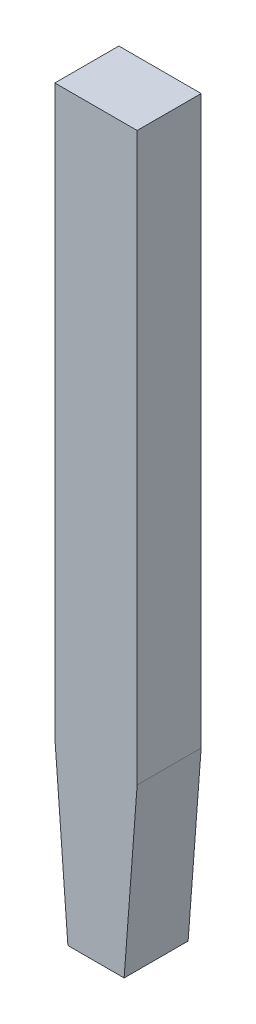
ISO-10303-21;
HEADER;
FILE_DESCRIPTION(('STEP AP214'),'2;1');
FILE_NAME('part.step','',(''),(''),'','','');
FILE_SCHEMA(('AUTOMOTIVE_DESIGN { 1 0 10303 214 1 1 1 1 }'));
ENDSEC;
DATA;
#1=APPLICATION_CONTEXT('core data for automotive mechanical design processes');
#2=APPLICATION_PROTOCOL_DEFINITION('international standard','automotive_design',2000,#1);
#3=PRODUCT_CONTEXT('',#1,'mechanical');
#4=PRODUCT('Part','Part','',(#3));
#5=PRODUCT_RELATED_PRODUCT_CATEGORY('part','',(#4));
#6=PRODUCT_DEFINITION_FORMATION('','',#4);
#7=PRODUCT_DEFINITION_CONTEXT('part definition',#1,'design');
#8=PRODUCT_DEFINITION('design','',#6,#7);
#9=PRODUCT_DEFINITION_SHAPE('','',#8);
#10=(LENGTH_UNIT() NAMED_UNIT(*) SI_UNIT(.MILLI.,.METRE.));
#11=(NAMED_UNIT(*) PLANE_ANGLE_UNIT() SI_UNIT($,.RADIAN.));
#12=(NAMED_UNIT(*) SI_UNIT($,.STERADIAN.) SOLID_ANGLE_UNIT());
#13=UNCERTAINTY_MEASURE_WITH_UNIT(LENGTH_MEASURE(1.E-05),#10,'distance_accuracy_value','');
#14=(GEOMETRIC_REPRESENTATION_CONTEXT(3) GLOBAL_UNCERTAINTY_ASSIGNED_CONTEXT((#13)) GLOBAL_UNIT_ASSIGNED_CONTEXT((#10,
#11,#12)) REPRESENTATION_CONTEXT('',''));
#15=CARTESIAN_POINT('',(0.,0.,0.));
#16=DIRECTION('',(0.,0.,1.));
#17=DIRECTION('',(1.,0.,0.));
#18=AXIS2_PLACEMENT_3D('',#15,#16,#17);
#19=CARTESIAN_POINT('',(47.87457889831,-0.5212621897839,1.165000000046));
#20=DIRECTION('',(0.,0.,1.));
#21=DIRECTION('',(1.,0.,0.));
#22=AXIS2_PLACEMENT_3D('',#19,#20,#21);
#23=PLANE('',#22);
#24=DIRECTION('',(1.,0.,0.));
#25=VECTOR('',#24,1.);
#26=CARTESIAN_POINT('',(38.93957889831,-15.17126218978,1.165000000046));
#27=LINE('',#26,#25);
#28=CARTESIAN_POINT('',(48.17082889831,-15.17126218978,1.165000000046));
#29=VERTEX_POINT('',#28);
#30=CARTESIAN_POINT('',(48.47832889831,-15.17126218978,1.165000000046));
#31=VERTEX_POINT('',#30);
#32=EDGE_CURVE('E94',#29,#31,#27,.T.);
#33=ORIENTED_EDGE('',*,*,#32,.T.);
#34=DIRECTION('',(0.0747899482416168,0.997199309888458,0.));
#35=VECTOR('',#34,1.);
#36=CARTESIAN_POINT('',(48.54957889831,-14.22126218978,1.165000000046));
#37=LINE('',#36,#35);
#38=CARTESIAN_POINT('',(48.54957889831,-14.2212621897804,1.165000000046));
#39=VERTEX_POINT('',#38);
#40=EDGE_CURVE('E98',#39,#31,#37,.F.);
#41=ORIENTED_EDGE('',*,*,#40,.F.);
#42=DIRECTION('',(0.,1.,0.));
#43=VECTOR('',#42,1.);
#44=CARTESIAN_POINT('',(48.54957889831,-7.321262189784,1.165000000046));
#45=LINE('',#44,#43);
#46=CARTESIAN_POINT('',(48.54957889831,-11.12202888849,1.165000000046));
#47=VERTEX_POINT('',#46);
#48=EDGE_CURVE('E83',#47,#39,#45,.F.);
#49=ORIENTED_EDGE('',*,*,#48,.F.);
#50=DIRECTION('',(1.,0.,0.));
#51=VECTOR('',#50,1.);
#52=CARTESIAN_POINT('',(44.47457889831,-11.12202888849,1.165000000046));
#53=LINE('',#52,#51);
#54=CARTESIAN_POINT('',(48.09957889831,-11.12202888849,1.165000000046));
#55=VERTEX_POINT('',#54);
#56=EDGE_CURVE('E20',#47,#55,#53,.F.);
#57=ORIENTED_EDGE('',*,*,#56,.T.);
#58=DIRECTION('',(0.,1.,0.));
#59=VECTOR('',#58,1.);
#60=CARTESIAN_POINT('',(48.09957889831,-7.321262189784,1.165000000046));
#61=LINE('',#60,#59);
#62=CARTESIAN_POINT('',(48.09957889831,-14.2212621897798,1.165000000046));
#63=VERTEX_POINT('',#62);
#64=EDGE_CURVE('E71',#63,#55,#61,.T.);
#65=ORIENTED_EDGE('',*,*,#64,.F.);
#66=DIRECTION('',(0.0747899482416168,-0.997199309888458,0.));
#67=VECTOR('',#66,1.);
#68=CARTESIAN_POINT('',(48.09957889831,-14.22126218978,1.165000000046));
#69=LINE('',#68,#67);
#70=EDGE_CURVE('E66',#29,#63,#69,.F.);
#71=ORIENTED_EDGE('',*,*,#70,.F.);
#72=EDGE_LOOP('',(#33,#41,#49,#57,#65,#71));
#73=FACE_BOUND('',#72,.T.);
#74=ADVANCED_FACE('F17',(#73),#23,.T.);
#75=CARTESIAN_POINT('',(44.47457889831,-11.12202888849,-0.158278306686));
#76=DIRECTION('',(0.,-1.,0.));
#77=DIRECTION('',(0.,0.,-1.));
#78=AXIS2_PLACEMENT_3D('',#75,#76,#77);
#79=PLANE('',#78);
#80=DIRECTION('',(1.,0.,0.));
#81=VECTOR('',#80,1.);
#82=CARTESIAN_POINT('',(47.87457889831,-11.12202888849,0.8150000000459));
#83=LINE('',#82,#81);
#84=CARTESIAN_POINT('',(48.54957889831,-11.12202888849,0.8150000000459));
#85=VERTEX_POINT('',#84);
#86=CARTESIAN_POINT('',(48.09957889831,-11.12202888849,0.8150000000459));
#87=VERTEX_POINT('',#86);
#88=EDGE_CURVE('E89',#85,#87,#83,.F.);
#89=ORIENTED_EDGE('',*,*,#88,.T.);
#90=DIRECTION('',(0.,0.,1.));
#91=VECTOR('',#90,1.);
#92=CARTESIAN_POINT('',(48.09957889831,-11.12202888849,0.8150000000459));
#93=LINE('',#92,#91);
#94=EDGE_CURVE('E76',#55,#87,#93,.F.);
#95=ORIENTED_EDGE('',*,*,#94,.F.);
#96=ORIENTED_EDGE('',*,*,#56,.F.);
#97=DIRECTION('',(0.,0.,-1.));
#98=VECTOR('',#97,1.);
#99=CARTESIAN_POINT('',(48.54957889831,-11.12202888849,0.8150000000459));
#100=LINE('',#99,#98);
#101=EDGE_CURVE('E102',#85,#47,#100,.F.);
#102=ORIENTED_EDGE('',*,*,#101,.F.);
#103=EDGE_LOOP('',(#89,#95,#96,#102));
#104=FACE_BOUND('',#103,.T.);
#105=ADVANCED_FACE('F88',(#104),#79,.F.);
#106=CARTESIAN_POINT('',(48.09957889831,-7.321262189784,0.8150000000459));
#107=DIRECTION('',(-1.,0.,0.));
#108=DIRECTION('',(0.,0.,1.));
#109=AXIS2_PLACEMENT_3D('',#106,#107,#108);
#110=PLANE('',#109);
#111=DIRECTION('',(0.,1.,0.));
#112=VECTOR('',#111,1.);
#113=CARTESIAN_POINT('',(48.09957889831,-0.5212621897839,0.8150000000459));
#114=LINE('',#113,#112);
#115=CARTESIAN_POINT('',(48.09957889831,-14.2212621897799,0.8150000000459));
#116=VERTEX_POINT('',#115);
#117=EDGE_CURVE('E107',#87,#116,#114,.F.);
#118=ORIENTED_EDGE('',*,*,#117,.T.);
#119=DIRECTION('',(0.,0.,1.));
#120=VECTOR('',#119,1.);
#121=CARTESIAN_POINT('',(48.09957889831,-14.22126218978,0.8150000000459));
#122=LINE('',#121,#120);
#123=EDGE_CURVE('E78',#63,#116,#122,.F.);
#124=ORIENTED_EDGE('',*,*,#123,.F.);
#125=ORIENTED_EDGE('',*,*,#64,.T.);
#126=ORIENTED_EDGE('',*,*,#94,.T.);
#127=EDGE_LOOP('',(#118,#124,#125,#126));
#128=FACE_BOUND('',#127,.T.);
#129=ADVANCED_FACE('F74',(#128),#110,.T.);
#130=CARTESIAN_POINT('',(48.09957889831,-14.22126218978,0.8150000000459));
#131=DIRECTION('',(-0.997199309888458,-0.0747899482416168,0.));
#132=DIRECTION('',(0.0747899482416168,-0.997199309888458,0.));
#133=AXIS2_PLACEMENT_3D('',#130,#131,#132);
#134=PLANE('',#133);
#135=ORIENTED_EDGE('',*,*,#70,.T.);
#136=ORIENTED_EDGE('',*,*,#123,.T.);
#137=DIRECTION('',(0.0747899482416361,-0.997199309888456,0.));
#138=VECTOR('',#137,1.);
#139=CARTESIAN_POINT('',(48.09957889831,-14.22126218978,0.8150000000459));
#140=LINE('',#139,#138);
#141=CARTESIAN_POINT('',(48.17082889831,-15.17126218978,0.8150000000459));
#142=VERTEX_POINT('',#141);
#143=EDGE_CURVE('E109',#116,#142,#140,.T.);
#144=ORIENTED_EDGE('',*,*,#143,.T.);
#145=DIRECTION('',(0.,0.,1.));
#146=VECTOR('',#145,1.);
#147=CARTESIAN_POINT('',(48.17082889831,-15.17126218978,-0.8137967800219));
#148=LINE('',#147,#146);
#149=EDGE_CURVE('E96',#142,#29,#148,.T.);
#150=ORIENTED_EDGE('',*,*,#149,.T.);
#151=EDGE_LOOP('',(#135,#136,#144,#150));
#152=FACE_BOUND('',#151,.T.);
#153=ADVANCED_FACE('F126',(#152),#134,.T.);
#154=CARTESIAN_POINT('',(38.93957889831,-15.17126218978,-0.8137967800219));
#155=DIRECTION('',(0.,1.,0.));
#156=DIRECTION('',(0.,0.,1.));
#157=AXIS2_PLACEMENT_3D('',#154,#155,#156);
#158=PLANE('',#157);
#159=DIRECTION('',(1.,0.,0.));
#160=VECTOR('',#159,1.);
#161=CARTESIAN_POINT('',(47.87457889831,-15.17126218978,0.8150000000459));
#162=LINE('',#161,#160);
#163=CARTESIAN_POINT('',(48.47832889831,-15.17126218978,0.8150000000459));
#164=VERTEX_POINT('',#163);
#165=EDGE_CURVE('E112',#142,#164,#162,.T.);
#166=ORIENTED_EDGE('',*,*,#165,.T.);
#167=DIRECTION('',(0.,0.,1.));
#168=VECTOR('',#167,1.);
#169=CARTESIAN_POINT('',(48.47832889831,-15.17126218978,0.8150000000459));
#170=LINE('',#169,#168);
#171=EDGE_CURVE('E100',#31,#164,#170,.F.);
#172=ORIENTED_EDGE('',*,*,#171,.F.);
#173=ORIENTED_EDGE('',*,*,#32,.F.);
#174=ORIENTED_EDGE('',*,*,#149,.F.);
#175=EDGE_LOOP('',(#166,#172,#173,#174));
#176=FACE_BOUND('',#175,.T.);
#177=ADVANCED_FACE('F125',(#176),#158,.F.);
#178=CARTESIAN_POINT('',(48.54957889831,-14.22126218978,0.8150000000459));
#179=DIRECTION('',(0.997199309888458,-0.0747899482416168,0.));
#180=DIRECTION('',(0.0747899482416168,0.997199309888458,0.));
#181=AXIS2_PLACEMENT_3D('',#178,#179,#180);
#182=PLANE('',#181);
#183=DIRECTION('',(0.0747899482416433,0.997199309888456,0.));
#184=VECTOR('',#183,1.);
#185=CARTESIAN_POINT('',(48.47832889831,-15.17126218978,0.8150000000459));
#186=LINE('',#185,#184);
#187=CARTESIAN_POINT('',(48.54957889831,-14.22126218978,0.8150000000459));
#188=VERTEX_POINT('',#187);
#189=EDGE_CURVE('E26',#164,#188,#186,.T.);
#190=ORIENTED_EDGE('',*,*,#189,.T.);
#191=DIRECTION('',(0.,0.,-1.));
#192=VECTOR('',#191,1.);
#193=CARTESIAN_POINT('',(48.54957889831,-14.22126218978,0.8150000000459));
#194=LINE('',#193,#192);
#195=EDGE_CURVE('E34',#39,#188,#194,.T.);
#196=ORIENTED_EDGE('',*,*,#195,.F.);
#197=ORIENTED_EDGE('',*,*,#40,.T.);
#198=ORIENTED_EDGE('',*,*,#171,.T.);
#199=EDGE_LOOP('',(#190,#196,#197,#198));
#200=FACE_BOUND('',#199,.T.);
#201=ADVANCED_FACE('F118',(#200),#182,.T.);
#202=CARTESIAN_POINT('',(48.54957889831,-7.321262189784,0.8150000000459));
#203=DIRECTION('',(1.,0.,0.));
#204=DIRECTION('',(0.,0.,-1.));
#205=AXIS2_PLACEMENT_3D('',#202,#203,#204);
#206=PLANE('',#205);
#207=ORIENTED_EDGE('',*,*,#48,.T.);
#208=ORIENTED_EDGE('',*,*,#195,.T.);
#209=DIRECTION('',(0.,1.,0.));
#210=VECTOR('',#209,1.);
#211=CARTESIAN_POINT('',(48.54957889831,-0.5212621897839,0.8150000000459));
#212=LINE('',#211,#210);
#213=EDGE_CURVE('E11',#188,#85,#212,.T.);
#214=ORIENTED_EDGE('',*,*,#213,.T.);
#215=ORIENTED_EDGE('',*,*,#101,.T.);
#216=EDGE_LOOP('',(#207,#208,#214,#215));
#217=FACE_BOUND('',#216,.T.);
#218=ADVANCED_FACE('F127',(#217),#206,.T.);
#219=CARTESIAN_POINT('',(47.87457889831,-0.5212621897839,0.8150000000459));
#220=DIRECTION('',(0.,0.,1.));
#221=DIRECTION('',(1.,0.,0.));
#222=AXIS2_PLACEMENT_3D('',#219,#220,#221);
#223=PLANE('',#222);
#224=ORIENTED_EDGE('',*,*,#189,.F.);
#225=ORIENTED_EDGE('',*,*,#165,.F.);
#226=ORIENTED_EDGE('',*,*,#143,.F.);
#227=ORIENTED_EDGE('',*,*,#117,.F.);
#228=ORIENTED_EDGE('',*,*,#88,.F.);
#229=ORIENTED_EDGE('',*,*,#213,.F.);
#230=EDGE_LOOP('',(#224,#225,#226,#227,#228,#229));
#231=FACE_BOUND('',#230,.T.);
#232=ADVANCED_FACE('F122',(#231),#223,.F.);
#233=CLOSED_SHELL('',(#74,#105,#129,#153,#177,#201,#218,#232));
#234=MANIFOLD_SOLID_BREP('B1',#233);
#235=ADVANCED_BREP_SHAPE_REPRESENTATION('',(#18,#234),#14);
#236=SHAPE_DEFINITION_REPRESENTATION(#9,#235);
ENDSEC;
END-ISO-10303-21;
